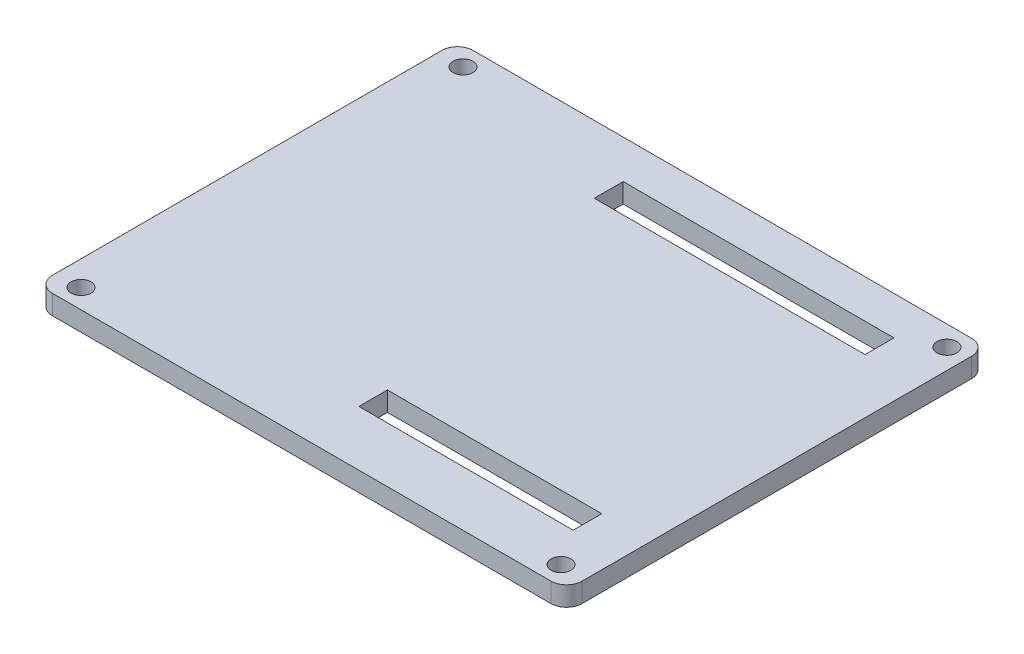
ISO-10303-21;
HEADER;
FILE_DESCRIPTION(('STEP AP214'),'2;1');
FILE_NAME('part.step','',(''),(''),'','','');
FILE_SCHEMA(('AUTOMOTIVE_DESIGN { 1 0 10303 214 1 1 1 1 }'));
ENDSEC;
DATA;
#1=APPLICATION_CONTEXT('core data for automotive mechanical design processes');
#2=APPLICATION_PROTOCOL_DEFINITION('international standard','automotive_design',2000,#1);
#3=PRODUCT_CONTEXT('',#1,'mechanical');
#4=PRODUCT('Part','Part','',(#3));
#5=PRODUCT_RELATED_PRODUCT_CATEGORY('part','',(#4));
#6=PRODUCT_DEFINITION_FORMATION('','',#4);
#7=PRODUCT_DEFINITION_CONTEXT('part definition',#1,'design');
#8=PRODUCT_DEFINITION('design','',#6,#7);
#9=PRODUCT_DEFINITION_SHAPE('','',#8);
#10=(LENGTH_UNIT() NAMED_UNIT(*) SI_UNIT(.MILLI.,.METRE.));
#11=(NAMED_UNIT(*) PLANE_ANGLE_UNIT() SI_UNIT($,.RADIAN.));
#12=(NAMED_UNIT(*) SI_UNIT($,.STERADIAN.) SOLID_ANGLE_UNIT());
#13=UNCERTAINTY_MEASURE_WITH_UNIT(LENGTH_MEASURE(1.E-05),#10,'distance_accuracy_value','');
#14=(GEOMETRIC_REPRESENTATION_CONTEXT(3) GLOBAL_UNCERTAINTY_ASSIGNED_CONTEXT((#13)) GLOBAL_UNIT_ASSIGNED_CONTEXT((#10,
#11,#12)) REPRESENTATION_CONTEXT('',''));
#15=CARTESIAN_POINT('',(0.,0.,0.));
#16=DIRECTION('',(0.,0.,1.));
#17=DIRECTION('',(1.,0.,0.));
#18=AXIS2_PLACEMENT_3D('',#15,#16,#17);
#19=CARTESIAN_POINT('',(0.,3.175,0.));
#20=DIRECTION('',(1.,0.,0.));
#21=DIRECTION('',(0.,0.,-1.));
#22=AXIS2_PLACEMENT_3D('',#19,#20,#21);
#23=PLANE('',#22);
#24=DIRECTION('',(0.,0.,1.));
#25=VECTOR('',#24,1.);
#26=CARTESIAN_POINT('',(0.,0.,0.));
#27=LINE('',#26,#25);
#28=CARTESIAN_POINT('',(0.,0.,2.54));
#29=VERTEX_POINT('',#28);
#30=CARTESIAN_POINT('',(0.,0.,66.04));
#31=VERTEX_POINT('',#30);
#32=EDGE_CURVE('E235',#29,#31,#27,.T.);
#33=ORIENTED_EDGE('',*,*,#32,.T.);
#34=DIRECTION('',(0.,-1.,0.));
#35=VECTOR('',#34,1.);
#36=CARTESIAN_POINT('',(0.,3.175,66.04));
#37=LINE('',#36,#35);
#38=CARTESIAN_POINT('',(0.,3.175,66.04));
#39=VERTEX_POINT('',#38);
#40=EDGE_CURVE('E277',#31,#39,#37,.F.);
#41=ORIENTED_EDGE('',*,*,#40,.T.);
#42=DIRECTION('',(0.,0.,1.));
#43=VECTOR('',#42,1.);
#44=CARTESIAN_POINT('',(0.,3.175,0.));
#45=LINE('',#44,#43);
#46=CARTESIAN_POINT('',(0.,3.175,2.54));
#47=VERTEX_POINT('',#46);
#48=EDGE_CURVE('E238',#47,#39,#45,.T.);
#49=ORIENTED_EDGE('',*,*,#48,.F.);
#50=DIRECTION('',(0.,-1.,0.));
#51=VECTOR('',#50,1.);
#52=CARTESIAN_POINT('',(0.,3.175,2.54));
#53=LINE('',#52,#51);
#54=EDGE_CURVE('E274',#47,#29,#53,.T.);
#55=ORIENTED_EDGE('',*,*,#54,.T.);
#56=EDGE_LOOP('',(#33,#41,#49,#55));
#57=FACE_BOUND('',#56,.T.);
#58=ADVANCED_FACE('F32',(#57),#23,.F.);
#59=CARTESIAN_POINT('',(0.,3.175,68.58));
#60=DIRECTION('',(0.,0.,-1.));
#61=DIRECTION('',(-1.,0.,0.));
#62=AXIS2_PLACEMENT_3D('',#59,#60,#61);
#63=PLANE('',#62);
#64=DIRECTION('',(1.,0.,0.));
#65=VECTOR('',#64,1.);
#66=CARTESIAN_POINT('',(0.,3.175,68.58));
#67=LINE('',#66,#65);
#68=CARTESIAN_POINT('',(2.54000000000001,3.175,68.58));
#69=VERTEX_POINT('',#68);
#70=CARTESIAN_POINT('',(83.82,3.175,68.58));
#71=VERTEX_POINT('',#70);
#72=EDGE_CURVE('E241',#69,#71,#67,.T.);
#73=ORIENTED_EDGE('',*,*,#72,.F.);
#74=DIRECTION('',(0.,-1.,0.));
#75=VECTOR('',#74,1.);
#76=CARTESIAN_POINT('',(2.54000000000001,3.175,68.58));
#77=LINE('',#76,#75);
#78=CARTESIAN_POINT('',(2.54000000000001,0.,68.58));
#79=VERTEX_POINT('',#78);
#80=EDGE_CURVE('E263',#69,#79,#77,.T.);
#81=ORIENTED_EDGE('',*,*,#80,.T.);
#82=DIRECTION('',(1.,0.,0.));
#83=VECTOR('',#82,1.);
#84=CARTESIAN_POINT('',(0.,0.,68.58));
#85=LINE('',#84,#83);
#86=CARTESIAN_POINT('',(83.82,0.,68.58));
#87=VERTEX_POINT('',#86);
#88=EDGE_CURVE('E254',#79,#87,#85,.T.);
#89=ORIENTED_EDGE('',*,*,#88,.T.);
#90=DIRECTION('',(0.,-1.,0.));
#91=VECTOR('',#90,1.);
#92=CARTESIAN_POINT('',(83.82,3.175,68.58));
#93=LINE('',#92,#91);
#94=EDGE_CURVE('E251',#87,#71,#93,.F.);
#95=ORIENTED_EDGE('',*,*,#94,.T.);
#96=EDGE_LOOP('',(#73,#81,#89,#95));
#97=FACE_BOUND('',#96,.T.);
#98=ADVANCED_FACE('F315',(#97),#63,.F.);
#99=CARTESIAN_POINT('',(86.36,3.175,0.));
#100=DIRECTION('',(-1.,0.,0.));
#101=DIRECTION('',(0.,0.,1.));
#102=AXIS2_PLACEMENT_3D('',#99,#100,#101);
#103=PLANE('',#102);
#104=DIRECTION('',(0.,0.,-1.));
#105=VECTOR('',#104,1.);
#106=CARTESIAN_POINT('',(86.36,3.175,0.));
#107=LINE('',#106,#105);
#108=CARTESIAN_POINT('',(86.36,3.175,66.04));
#109=VERTEX_POINT('',#108);
#110=CARTESIAN_POINT('',(86.36,3.175,2.54));
#111=VERTEX_POINT('',#110);
#112=EDGE_CURVE('E245',#109,#111,#107,.T.);
#113=ORIENTED_EDGE('',*,*,#112,.F.);
#114=DIRECTION('',(0.,-1.,0.));
#115=VECTOR('',#114,1.);
#116=CARTESIAN_POINT('',(86.36,3.175,66.04));
#117=LINE('',#116,#115);
#118=CARTESIAN_POINT('',(86.36,0.,66.04));
#119=VERTEX_POINT('',#118);
#120=EDGE_CURVE('E289',#109,#119,#117,.T.);
#121=ORIENTED_EDGE('',*,*,#120,.T.);
#122=DIRECTION('',(0.,0.,-1.));
#123=VECTOR('',#122,1.);
#124=CARTESIAN_POINT('',(86.36,0.,0.));
#125=LINE('',#124,#123);
#126=CARTESIAN_POINT('',(86.36,0.,2.54));
#127=VERTEX_POINT('',#126);
#128=EDGE_CURVE('E257',#119,#127,#125,.T.);
#129=ORIENTED_EDGE('',*,*,#128,.T.);
#130=DIRECTION('',(0.,-1.,0.));
#131=VECTOR('',#130,1.);
#132=CARTESIAN_POINT('',(86.36,3.175,2.54));
#133=LINE('',#132,#131);
#134=EDGE_CURVE('E287',#127,#111,#133,.F.);
#135=ORIENTED_EDGE('',*,*,#134,.T.);
#136=EDGE_LOOP('',(#113,#121,#129,#135));
#137=FACE_BOUND('',#136,.T.);
#138=ADVANCED_FACE('F324',(#137),#103,.F.);
#139=CARTESIAN_POINT('',(0.,3.175,0.));
#140=DIRECTION('',(0.,0.,1.));
#141=DIRECTION('',(1.,0.,0.));
#142=AXIS2_PLACEMENT_3D('',#139,#140,#141);
#143=PLANE('',#142);
#144=DIRECTION('',(-1.,0.,0.));
#145=VECTOR('',#144,1.);
#146=CARTESIAN_POINT('',(0.,3.175,0.));
#147=LINE('',#146,#145);
#148=CARTESIAN_POINT('',(83.82,3.175,0.));
#149=VERTEX_POINT('',#148);
#150=CARTESIAN_POINT('',(2.54,3.175,0.));
#151=VERTEX_POINT('',#150);
#152=EDGE_CURVE('E248',#149,#151,#147,.T.);
#153=ORIENTED_EDGE('',*,*,#152,.F.);
#154=DIRECTION('',(0.,-1.,0.));
#155=VECTOR('',#154,1.);
#156=CARTESIAN_POINT('',(83.82,3.175,0.));
#157=LINE('',#156,#155);
#158=CARTESIAN_POINT('',(83.82,0.,0.));
#159=VERTEX_POINT('',#158);
#160=EDGE_CURVE('E11',#149,#159,#157,.T.);
#161=ORIENTED_EDGE('',*,*,#160,.T.);
#162=DIRECTION('',(-1.,0.,0.));
#163=VECTOR('',#162,1.);
#164=CARTESIAN_POINT('',(0.,0.,0.));
#165=LINE('',#164,#163);
#166=CARTESIAN_POINT('',(2.54,0.,0.));
#167=VERTEX_POINT('',#166);
#168=EDGE_CURVE('E242',#159,#167,#165,.T.);
#169=ORIENTED_EDGE('',*,*,#168,.T.);
#170=DIRECTION('',(0.,-1.,0.));
#171=VECTOR('',#170,1.);
#172=CARTESIAN_POINT('',(2.54,3.175,0.));
#173=LINE('',#172,#171);
#174=EDGE_CURVE('E40',#167,#151,#173,.F.);
#175=ORIENTED_EDGE('',*,*,#174,.T.);
#176=EDGE_LOOP('',(#153,#161,#169,#175));
#177=FACE_BOUND('',#176,.T.);
#178=ADVANCED_FACE('F294',(#177),#143,.F.);
#179=CARTESIAN_POINT('',(0.,3.175,68.58));
#180=DIRECTION('',(0.,1.,0.));
#181=DIRECTION('',(0.,0.,1.));
#182=AXIS2_PLACEMENT_3D('',#179,#180,#181);
#183=PLANE('',#182);
#184=DIRECTION('',(0.,0.,1.));
#185=VECTOR('',#184,1.);
#186=CARTESIAN_POINT('',(43.5059533764265,3.175,59.5779422268278));
#187=LINE('',#186,#185);
#188=CARTESIAN_POINT('',(43.5059533764265,3.175,54.9195322154182));
#189=VERTEX_POINT('',#188);
#190=CARTESIAN_POINT('',(43.5059533764265,3.175,59.5779422268278));
#191=VERTEX_POINT('',#190);
#192=EDGE_CURVE('E47',#189,#191,#187,.T.);
#193=ORIENTED_EDGE('',*,*,#192,.F.);
#194=DIRECTION('',(-1.,0.,0.));
#195=VECTOR('',#194,1.);
#196=CARTESIAN_POINT('',(43.5059533764265,3.175,54.9195322154182));
#197=LINE('',#196,#195);
#198=CARTESIAN_POINT('',(78.4449932427369,3.175,54.9195322154182));
#199=VERTEX_POINT('',#198);
#200=EDGE_CURVE('E163',#199,#189,#197,.T.);
#201=ORIENTED_EDGE('',*,*,#200,.F.);
#202=DIRECTION('',(0.,0.,-1.));
#203=VECTOR('',#202,1.);
#204=CARTESIAN_POINT('',(78.4449932427369,3.175,59.5779422268278));
#205=LINE('',#204,#203);
#206=CARTESIAN_POINT('',(78.4449932427369,3.175,59.5779422268278));
#207=VERTEX_POINT('',#206);
#208=EDGE_CURVE('E166',#207,#199,#205,.T.);
#209=ORIENTED_EDGE('',*,*,#208,.F.);
#210=DIRECTION('',(1.,0.,0.));
#211=VECTOR('',#210,1.);
#212=CARTESIAN_POINT('',(43.5059533764265,3.175,59.5779422268278));
#213=LINE('',#212,#211);
#214=EDGE_CURVE('E172',#191,#207,#213,.T.);
#215=ORIENTED_EDGE('',*,*,#214,.F.);
#216=EDGE_LOOP('',(#193,#201,#209,#215));
#217=FACE_BOUND('',#216,.T.);
#218=DIRECTION('',(0.,0.,1.));
#219=VECTOR('',#218,1.);
#220=CARTESIAN_POINT('',(33.293149455498,3.175,6.27794222682778));
#221=LINE('',#220,#219);
#222=CARTESIAN_POINT('',(33.293149455498,3.175,6.27794222682778));
#223=VERTEX_POINT('',#222);
#224=CARTESIAN_POINT('',(33.293149455498,3.175,10.9907553059796));
#225=VERTEX_POINT('',#224);
#226=EDGE_CURVE('E178',#223,#225,#221,.T.);
#227=ORIENTED_EDGE('',*,*,#226,.F.);
#228=DIRECTION('',(-1.,0.,0.));
#229=VECTOR('',#228,1.);
#230=CARTESIAN_POINT('',(33.293149455498,3.175,6.27794222682778));
#231=LINE('',#230,#229);
#232=CARTESIAN_POINT('',(77.4390867704839,3.175,6.27794222682778));
#233=VERTEX_POINT('',#232);
#234=EDGE_CURVE('E186',#233,#223,#231,.T.);
#235=ORIENTED_EDGE('',*,*,#234,.F.);
#236=DIRECTION('',(0.,0.,-1.));
#237=VECTOR('',#236,1.);
#238=CARTESIAN_POINT('',(77.4390867704839,3.175,6.27794222682778));
#239=LINE('',#238,#237);
#240=CARTESIAN_POINT('',(77.4390867704839,3.175,10.9907553059796));
#241=VERTEX_POINT('',#240);
#242=EDGE_CURVE('E200',#241,#233,#239,.T.);
#243=ORIENTED_EDGE('',*,*,#242,.F.);
#244=DIRECTION('',(1.,0.,0.));
#245=VECTOR('',#244,1.);
#246=CARTESIAN_POINT('',(33.293149455498,3.175,10.9907553059796));
#247=LINE('',#246,#245);
#248=EDGE_CURVE('E197',#225,#241,#247,.T.);
#249=ORIENTED_EDGE('',*,*,#248,.F.);
#250=EDGE_LOOP('',(#227,#235,#243,#249));
#251=FACE_BOUND('',#250,.T.);
#252=CARTESIAN_POINT('',(4.05404530758346,3.175,65.4277777084644));
#253=DIRECTION('',(0.,1.,0.));
#254=DIRECTION('',(0.,0.,1.));
#255=AXIS2_PLACEMENT_3D('',#252,#253,#254);
#256=CIRCLE('',#255,1.6129);
#257=CARTESIAN_POINT('',(4.05404530758346,3.175,67.0406777084644));
#258=VERTEX_POINT('',#257);
#259=EDGE_CURVE('E207',#258,#258,#256,.T.);
#260=ORIENTED_EDGE('',*,*,#259,.F.);
#261=EDGE_LOOP('',(#260));
#262=FACE_BOUND('',#261,.T.);
#263=CARTESIAN_POINT('',(82.3059546924165,3.175,65.4277777084644));
#264=DIRECTION('',(0.,1.,0.));
#265=DIRECTION('',(0.,0.,1.));
#266=AXIS2_PLACEMENT_3D('',#263,#264,#265);
#267=CIRCLE('',#266,1.6129);
#268=CARTESIAN_POINT('',(82.3059546924165,3.175,67.0406777084644));
#269=VERTEX_POINT('',#268);
#270=EDGE_CURVE('E217',#269,#269,#267,.T.);
#271=ORIENTED_EDGE('',*,*,#270,.F.);
#272=EDGE_LOOP('',(#271));
#273=FACE_BOUND('',#272,.T.);
#274=CARTESIAN_POINT('',(83.0760512242138,3.175,3.28394877578617));
#275=DIRECTION('',(0.,1.,0.));
#276=DIRECTION('',(0.,0.,1.));
#277=AXIS2_PLACEMENT_3D('',#274,#275,#276);
#278=CIRCLE('',#277,1.6129);
#279=CARTESIAN_POINT('',(83.0760512242138,3.175,4.89684877578617));
#280=VERTEX_POINT('',#279);
#281=EDGE_CURVE('E223',#280,#280,#278,.T.);
#282=ORIENTED_EDGE('',*,*,#281,.F.);
#283=EDGE_LOOP('',(#282));
#284=FACE_BOUND('',#283,.T.);
#285=CARTESIAN_POINT('',(4.05404530758346,3.175,3.15222229153558));
#286=DIRECTION('',(0.,1.,0.));
#287=DIRECTION('',(0.,0.,1.));
#288=AXIS2_PLACEMENT_3D('',#285,#286,#287);
#289=CIRCLE('',#288,1.6129);
#290=CARTESIAN_POINT('',(4.05404530758346,3.175,4.76512229153558));
#291=VERTEX_POINT('',#290);
#292=EDGE_CURVE('E229',#291,#291,#289,.T.);
#293=ORIENTED_EDGE('',*,*,#292,.F.);
#294=EDGE_LOOP('',(#293));
#295=FACE_BOUND('',#294,.T.);
#296=ORIENTED_EDGE('',*,*,#48,.T.);
#297=CARTESIAN_POINT('',(2.54000000000001,3.175,66.04));
#298=DIRECTION('',(0.,1.,0.));
#299=DIRECTION('',(0.,0.,1.));
#300=AXIS2_PLACEMENT_3D('',#297,#298,#299);
#301=CIRCLE('',#300,2.54);
#302=EDGE_CURVE('E285',#39,#69,#301,.T.);
#303=ORIENTED_EDGE('',*,*,#302,.T.);
#304=ORIENTED_EDGE('',*,*,#72,.T.);
#305=CARTESIAN_POINT('',(83.82,3.175,66.04));
#306=DIRECTION('',(0.,1.,0.));
#307=DIRECTION('',(0.,0.,1.));
#308=AXIS2_PLACEMENT_3D('',#305,#306,#307);
#309=CIRCLE('',#308,2.54);
#310=EDGE_CURVE('E283',#71,#109,#309,.T.);
#311=ORIENTED_EDGE('',*,*,#310,.T.);
#312=ORIENTED_EDGE('',*,*,#112,.T.);
#313=CARTESIAN_POINT('',(83.82,3.175,2.54));
#314=DIRECTION('',(0.,1.,0.));
#315=DIRECTION('',(0.,0.,1.));
#316=AXIS2_PLACEMENT_3D('',#313,#314,#315);
#317=CIRCLE('',#316,2.54);
#318=EDGE_CURVE('E281',#111,#149,#317,.T.);
#319=ORIENTED_EDGE('',*,*,#318,.T.);
#320=ORIENTED_EDGE('',*,*,#152,.T.);
#321=CARTESIAN_POINT('',(2.54,3.175,2.54));
#322=DIRECTION('',(0.,1.,0.));
#323=DIRECTION('',(0.,0.,1.));
#324=AXIS2_PLACEMENT_3D('',#321,#322,#323);
#325=CIRCLE('',#324,2.54);
#326=EDGE_CURVE('E279',#151,#47,#325,.T.);
#327=ORIENTED_EDGE('',*,*,#326,.T.);
#328=EDGE_LOOP('',(#296,#303,#304,#311,#312,#319,#320,#327));
#329=FACE_BOUND('',#328,.T.);
#330=ADVANCED_FACE('F300',(#217,#251,#262,#273,#284,#295,#329),#183,.T.);
#331=CARTESIAN_POINT('',(0.,0.,68.58));
#332=DIRECTION('',(0.,1.,0.));
#333=DIRECTION('',(0.,0.,1.));
#334=AXIS2_PLACEMENT_3D('',#331,#332,#333);
#335=PLANE('',#334);
#336=DIRECTION('',(-1.,0.,0.));
#337=VECTOR('',#336,1.);
#338=CARTESIAN_POINT('',(43.5059533764265,0.,54.9195322154182));
#339=LINE('',#338,#337);
#340=CARTESIAN_POINT('',(78.4449932427369,0.,54.9195322154182));
#341=VERTEX_POINT('',#340);
#342=CARTESIAN_POINT('',(43.5059533764265,0.,54.9195322154182));
#343=VERTEX_POINT('',#342);
#344=EDGE_CURVE('E153',#341,#343,#339,.T.);
#345=ORIENTED_EDGE('',*,*,#344,.T.);
#346=DIRECTION('',(0.,0.,1.));
#347=VECTOR('',#346,1.);
#348=CARTESIAN_POINT('',(43.5059533764265,0.,59.5779422268278));
#349=LINE('',#348,#347);
#350=CARTESIAN_POINT('',(43.5059533764265,0.,59.5779422268278));
#351=VERTEX_POINT('',#350);
#352=EDGE_CURVE('E147',#343,#351,#349,.T.);
#353=ORIENTED_EDGE('',*,*,#352,.T.);
#354=DIRECTION('',(1.,0.,0.));
#355=VECTOR('',#354,1.);
#356=CARTESIAN_POINT('',(43.5059533764265,0.,59.5779422268278));
#357=LINE('',#356,#355);
#358=CARTESIAN_POINT('',(78.4449932427369,0.,59.5779422268278));
#359=VERTEX_POINT('',#358);
#360=EDGE_CURVE('E156',#351,#359,#357,.T.);
#361=ORIENTED_EDGE('',*,*,#360,.T.);
#362=DIRECTION('',(0.,0.,-1.));
#363=VECTOR('',#362,1.);
#364=CARTESIAN_POINT('',(78.4449932427369,0.,59.5779422268278));
#365=LINE('',#364,#363);
#366=EDGE_CURVE('E55',#359,#341,#365,.T.);
#367=ORIENTED_EDGE('',*,*,#366,.T.);
#368=EDGE_LOOP('',(#345,#353,#361,#367));
#369=FACE_BOUND('',#368,.T.);
#370=DIRECTION('',(-1.,0.,0.));
#371=VECTOR('',#370,1.);
#372=CARTESIAN_POINT('',(33.293149455498,0.,6.27794222682778));
#373=LINE('',#372,#371);
#374=CARTESIAN_POINT('',(77.4390867704839,0.,6.27794222682778));
#375=VERTEX_POINT('',#374);
#376=CARTESIAN_POINT('',(33.293149455498,0.,6.27794222682778));
#377=VERTEX_POINT('',#376);
#378=EDGE_CURVE('E192',#375,#377,#373,.T.);
#379=ORIENTED_EDGE('',*,*,#378,.T.);
#380=DIRECTION('',(0.,0.,1.));
#381=VECTOR('',#380,1.);
#382=CARTESIAN_POINT('',(33.293149455498,0.,6.27794222682778));
#383=LINE('',#382,#381);
#384=CARTESIAN_POINT('',(33.293149455498,0.,10.9907553059796));
#385=VERTEX_POINT('',#384);
#386=EDGE_CURVE('E182',#377,#385,#383,.T.);
#387=ORIENTED_EDGE('',*,*,#386,.T.);
#388=DIRECTION('',(1.,0.,0.));
#389=VECTOR('',#388,1.);
#390=CARTESIAN_POINT('',(33.293149455498,0.,10.9907553059796));
#391=LINE('',#390,#389);
#392=CARTESIAN_POINT('',(77.4390867704839,0.,10.9907553059796));
#393=VERTEX_POINT('',#392);
#394=EDGE_CURVE('E185',#385,#393,#391,.T.);
#395=ORIENTED_EDGE('',*,*,#394,.T.);
#396=DIRECTION('',(0.,0.,-1.));
#397=VECTOR('',#396,1.);
#398=CARTESIAN_POINT('',(77.4390867704839,0.,6.27794222682778));
#399=LINE('',#398,#397);
#400=EDGE_CURVE('E189',#393,#375,#399,.T.);
#401=ORIENTED_EDGE('',*,*,#400,.T.);
#402=EDGE_LOOP('',(#379,#387,#395,#401));
#403=FACE_BOUND('',#402,.T.);
#404=CARTESIAN_POINT('',(4.05404530758346,0.,65.4277777084644));
#405=DIRECTION('',(0.,1.,0.));
#406=DIRECTION('',(0.,0.,1.));
#407=AXIS2_PLACEMENT_3D('',#404,#405,#406);
#408=CIRCLE('',#407,1.6129);
#409=CARTESIAN_POINT('',(4.05404530758346,0.,67.0406777084644));
#410=VERTEX_POINT('',#409);
#411=EDGE_CURVE('E214',#410,#410,#408,.T.);
#412=ORIENTED_EDGE('',*,*,#411,.T.);
#413=EDGE_LOOP('',(#412));
#414=FACE_BOUND('',#413,.T.);
#415=CARTESIAN_POINT('',(82.3059546924165,0.,65.4277777084644));
#416=DIRECTION('',(0.,1.,0.));
#417=DIRECTION('',(0.,0.,1.));
#418=AXIS2_PLACEMENT_3D('',#415,#416,#417);
#419=CIRCLE('',#418,1.6129);
#420=CARTESIAN_POINT('',(82.3059546924165,0.,67.0406777084644));
#421=VERTEX_POINT('',#420);
#422=EDGE_CURVE('E220',#421,#421,#419,.T.);
#423=ORIENTED_EDGE('',*,*,#422,.T.);
#424=EDGE_LOOP('',(#423));
#425=FACE_BOUND('',#424,.T.);
#426=CARTESIAN_POINT('',(83.0760512242138,0.,3.28394877578617));
#427=DIRECTION('',(0.,1.,0.));
#428=DIRECTION('',(0.,0.,1.));
#429=AXIS2_PLACEMENT_3D('',#426,#427,#428);
#430=CIRCLE('',#429,1.6129);
#431=CARTESIAN_POINT('',(83.0760512242138,0.,4.89684877578617));
#432=VERTEX_POINT('',#431);
#433=EDGE_CURVE('E226',#432,#432,#430,.T.);
#434=ORIENTED_EDGE('',*,*,#433,.T.);
#435=EDGE_LOOP('',(#434));
#436=FACE_BOUND('',#435,.T.);
#437=CARTESIAN_POINT('',(4.05404530758346,0.,3.15222229153558));
#438=DIRECTION('',(0.,1.,0.));
#439=DIRECTION('',(0.,0.,1.));
#440=AXIS2_PLACEMENT_3D('',#437,#438,#439);
#441=CIRCLE('',#440,1.6129);
#442=CARTESIAN_POINT('',(4.05404530758346,0.,4.76512229153558));
#443=VERTEX_POINT('',#442);
#444=EDGE_CURVE('E232',#443,#443,#441,.T.);
#445=ORIENTED_EDGE('',*,*,#444,.T.);
#446=EDGE_LOOP('',(#445));
#447=FACE_BOUND('',#446,.T.);
#448=ORIENTED_EDGE('',*,*,#88,.F.);
#449=CARTESIAN_POINT('',(2.54000000000001,0.,66.04));
#450=DIRECTION('',(0.,1.,0.));
#451=DIRECTION('',(0.,0.,1.));
#452=AXIS2_PLACEMENT_3D('',#449,#450,#451);
#453=CIRCLE('',#452,2.54);
#454=EDGE_CURVE('E272',#79,#31,#453,.F.);
#455=ORIENTED_EDGE('',*,*,#454,.T.);
#456=ORIENTED_EDGE('',*,*,#32,.F.);
#457=CARTESIAN_POINT('',(2.54,0.,2.54));
#458=DIRECTION('',(0.,1.,0.));
#459=DIRECTION('',(0.,0.,1.));
#460=AXIS2_PLACEMENT_3D('',#457,#458,#459);
#461=CIRCLE('',#460,2.54);
#462=EDGE_CURVE('E266',#29,#167,#461,.F.);
#463=ORIENTED_EDGE('',*,*,#462,.T.);
#464=ORIENTED_EDGE('',*,*,#168,.F.);
#465=CARTESIAN_POINT('',(83.82,0.,2.54));
#466=DIRECTION('',(0.,1.,0.));
#467=DIRECTION('',(0.,0.,1.));
#468=AXIS2_PLACEMENT_3D('',#465,#466,#467);
#469=CIRCLE('',#468,2.54);
#470=EDGE_CURVE('E268',#159,#127,#469,.F.);
#471=ORIENTED_EDGE('',*,*,#470,.T.);
#472=ORIENTED_EDGE('',*,*,#128,.F.);
#473=CARTESIAN_POINT('',(83.82,0.,66.04));
#474=DIRECTION('',(0.,1.,0.));
#475=DIRECTION('',(0.,0.,1.));
#476=AXIS2_PLACEMENT_3D('',#473,#474,#475);
#477=CIRCLE('',#476,2.54);
#478=EDGE_CURVE('E270',#119,#87,#477,.F.);
#479=ORIENTED_EDGE('',*,*,#478,.T.);
#480=EDGE_LOOP('',(#448,#455,#456,#463,#464,#471,#472,#479));
#481=FACE_BOUND('',#480,.T.);
#482=ADVANCED_FACE('F160',(#369,#403,#414,#425,#436,#447,#481),#335,.F.);
#483=CARTESIAN_POINT('',(2.54000000000001,3.175,66.04));
#484=DIRECTION('',(0.,-1.,0.));
#485=DIRECTION('',(0.,0.,-1.));
#486=AXIS2_PLACEMENT_3D('',#483,#484,#485);
#487=CYLINDRICAL_SURFACE('',#486,2.54);
#488=ORIENTED_EDGE('',*,*,#302,.F.);
#489=ORIENTED_EDGE('',*,*,#40,.F.);
#490=ORIENTED_EDGE('',*,*,#454,.F.);
#491=ORIENTED_EDGE('',*,*,#80,.F.);
#492=EDGE_LOOP('',(#488,#489,#490,#491));
#493=FACE_BOUND('',#492,.T.);
#494=ADVANCED_FACE('F312',(#493),#487,.T.);
#495=CARTESIAN_POINT('',(83.82,3.175,66.04));
#496=DIRECTION('',(0.,-1.,0.));
#497=DIRECTION('',(0.,0.,-1.));
#498=AXIS2_PLACEMENT_3D('',#495,#496,#497);
#499=CYLINDRICAL_SURFACE('',#498,2.54);
#500=ORIENTED_EDGE('',*,*,#310,.F.);
#501=ORIENTED_EDGE('',*,*,#94,.F.);
#502=ORIENTED_EDGE('',*,*,#478,.F.);
#503=ORIENTED_EDGE('',*,*,#120,.F.);
#504=EDGE_LOOP('',(#500,#501,#502,#503));
#505=FACE_BOUND('',#504,.T.);
#506=ADVANCED_FACE('F321',(#505),#499,.T.);
#507=CARTESIAN_POINT('',(83.82,3.175,2.54));
#508=DIRECTION('',(0.,-1.,0.));
#509=DIRECTION('',(0.,0.,-1.));
#510=AXIS2_PLACEMENT_3D('',#507,#508,#509);
#511=CYLINDRICAL_SURFACE('',#510,2.54);
#512=ORIENTED_EDGE('',*,*,#318,.F.);
#513=ORIENTED_EDGE('',*,*,#134,.F.);
#514=ORIENTED_EDGE('',*,*,#470,.F.);
#515=ORIENTED_EDGE('',*,*,#160,.F.);
#516=EDGE_LOOP('',(#512,#513,#514,#515));
#517=FACE_BOUND('',#516,.T.);
#518=ADVANCED_FACE('F327',(#517),#511,.T.);
#519=CARTESIAN_POINT('',(2.54,3.175,2.54));
#520=DIRECTION('',(0.,-1.,0.));
#521=DIRECTION('',(0.,0.,-1.));
#522=AXIS2_PLACEMENT_3D('',#519,#520,#521);
#523=CYLINDRICAL_SURFACE('',#522,2.54);
#524=ORIENTED_EDGE('',*,*,#326,.F.);
#525=ORIENTED_EDGE('',*,*,#174,.F.);
#526=ORIENTED_EDGE('',*,*,#462,.F.);
#527=ORIENTED_EDGE('',*,*,#54,.F.);
#528=EDGE_LOOP('',(#524,#525,#526,#527));
#529=FACE_BOUND('',#528,.T.);
#530=ADVANCED_FACE('F34',(#529),#523,.T.);
#531=CARTESIAN_POINT('',(4.05404530758346,0.,3.15222229153558));
#532=DIRECTION('',(0.,1.,0.));
#533=DIRECTION('',(0.,0.,1.));
#534=AXIS2_PLACEMENT_3D('',#531,#532,#533);
#535=CYLINDRICAL_SURFACE('',#534,1.6129);
#536=ORIENTED_EDGE('',*,*,#444,.F.);
#537=EDGE_LOOP('',(#536));
#538=FACE_BOUND('',#537,.T.);
#539=ORIENTED_EDGE('',*,*,#292,.T.);
#540=EDGE_LOOP('',(#539));
#541=FACE_BOUND('',#540,.T.);
#542=ADVANCED_FACE('F333',(#538,#541),#535,.F.);
#543=CARTESIAN_POINT('',(83.0760512242138,0.,3.28394877578617));
#544=DIRECTION('',(0.,1.,0.));
#545=DIRECTION('',(0.,0.,1.));
#546=AXIS2_PLACEMENT_3D('',#543,#544,#545);
#547=CYLINDRICAL_SURFACE('',#546,1.6129);
#548=ORIENTED_EDGE('',*,*,#433,.F.);
#549=EDGE_LOOP('',(#548));
#550=FACE_BOUND('',#549,.T.);
#551=ORIENTED_EDGE('',*,*,#281,.T.);
#552=EDGE_LOOP('',(#551));
#553=FACE_BOUND('',#552,.T.);
#554=ADVANCED_FACE('F403',(#550,#553),#547,.F.);
#555=CARTESIAN_POINT('',(82.3059546924165,0.,65.4277777084644));
#556=DIRECTION('',(0.,1.,0.));
#557=DIRECTION('',(0.,0.,1.));
#558=AXIS2_PLACEMENT_3D('',#555,#556,#557);
#559=CYLINDRICAL_SURFACE('',#558,1.6129);
#560=ORIENTED_EDGE('',*,*,#422,.F.);
#561=EDGE_LOOP('',(#560));
#562=FACE_BOUND('',#561,.T.);
#563=ORIENTED_EDGE('',*,*,#270,.T.);
#564=EDGE_LOOP('',(#563));
#565=FACE_BOUND('',#564,.T.);
#566=ADVANCED_FACE('F411',(#562,#565),#559,.F.);
#567=CARTESIAN_POINT('',(4.05404530758346,0.,65.4277777084644));
#568=DIRECTION('',(0.,1.,0.));
#569=DIRECTION('',(0.,0.,1.));
#570=AXIS2_PLACEMENT_3D('',#567,#568,#569);
#571=CYLINDRICAL_SURFACE('',#570,1.6129);
#572=ORIENTED_EDGE('',*,*,#411,.F.);
#573=EDGE_LOOP('',(#572));
#574=FACE_BOUND('',#573,.T.);
#575=ORIENTED_EDGE('',*,*,#259,.T.);
#576=EDGE_LOOP('',(#575));
#577=FACE_BOUND('',#576,.T.);
#578=ADVANCED_FACE('F420',(#574,#577),#571,.F.);
#579=CARTESIAN_POINT('',(33.293149455498,0.,6.27794222682778));
#580=DIRECTION('',(-1.,0.,0.));
#581=DIRECTION('',(0.,0.,1.));
#582=AXIS2_PLACEMENT_3D('',#579,#580,#581);
#583=PLANE('',#582);
#584=ORIENTED_EDGE('',*,*,#226,.T.);
#585=DIRECTION('',(0.,1.,0.));
#586=VECTOR('',#585,1.);
#587=CARTESIAN_POINT('',(33.293149455498,0.,10.9907553059796));
#588=LINE('',#587,#586);
#589=EDGE_CURVE('E195',#385,#225,#588,.T.);
#590=ORIENTED_EDGE('',*,*,#589,.F.);
#591=ORIENTED_EDGE('',*,*,#386,.F.);
#592=DIRECTION('',(0.,1.,0.));
#593=VECTOR('',#592,1.);
#594=CARTESIAN_POINT('',(33.293149455498,0.,6.27794222682778));
#595=LINE('',#594,#593);
#596=EDGE_CURVE('E205',#377,#223,#595,.T.);
#597=ORIENTED_EDGE('',*,*,#596,.T.);
#598=EDGE_LOOP('',(#584,#590,#591,#597));
#599=FACE_BOUND('',#598,.T.);
#600=ADVANCED_FACE('F428',(#599),#583,.F.);
#601=CARTESIAN_POINT('',(33.293149455498,0.,6.27794222682778));
#602=DIRECTION('',(0.,0.,-1.));
#603=DIRECTION('',(-1.,0.,0.));
#604=AXIS2_PLACEMENT_3D('',#601,#602,#603);
#605=PLANE('',#604);
#606=ORIENTED_EDGE('',*,*,#234,.T.);
#607=ORIENTED_EDGE('',*,*,#596,.F.);
#608=ORIENTED_EDGE('',*,*,#378,.F.);
#609=DIRECTION('',(0.,1.,0.));
#610=VECTOR('',#609,1.);
#611=CARTESIAN_POINT('',(77.4390867704839,0.,6.27794222682778));
#612=LINE('',#611,#610);
#613=EDGE_CURVE('E208',#375,#233,#612,.T.);
#614=ORIENTED_EDGE('',*,*,#613,.T.);
#615=EDGE_LOOP('',(#606,#607,#608,#614));
#616=FACE_BOUND('',#615,.T.);
#617=ADVANCED_FACE('F436',(#616),#605,.F.);
#618=CARTESIAN_POINT('',(77.4390867704839,0.,6.27794222682778));
#619=DIRECTION('',(1.,0.,0.));
#620=DIRECTION('',(0.,0.,-1.));
#621=AXIS2_PLACEMENT_3D('',#618,#619,#620);
#622=PLANE('',#621);
#623=ORIENTED_EDGE('',*,*,#242,.T.);
#624=ORIENTED_EDGE('',*,*,#613,.F.);
#625=ORIENTED_EDGE('',*,*,#400,.F.);
#626=DIRECTION('',(0.,1.,0.));
#627=VECTOR('',#626,1.);
#628=CARTESIAN_POINT('',(77.4390867704839,0.,10.9907553059796));
#629=LINE('',#628,#627);
#630=EDGE_CURVE('E210',#393,#241,#629,.T.);
#631=ORIENTED_EDGE('',*,*,#630,.T.);
#632=EDGE_LOOP('',(#623,#624,#625,#631));
#633=FACE_BOUND('',#632,.T.);
#634=ADVANCED_FACE('F445',(#633),#622,.F.);
#635=CARTESIAN_POINT('',(33.293149455498,0.,10.9907553059796));
#636=DIRECTION('',(0.,0.,1.));
#637=DIRECTION('',(1.,0.,0.));
#638=AXIS2_PLACEMENT_3D('',#635,#636,#637);
#639=PLANE('',#638);
#640=ORIENTED_EDGE('',*,*,#248,.T.);
#641=ORIENTED_EDGE('',*,*,#630,.F.);
#642=ORIENTED_EDGE('',*,*,#394,.F.);
#643=ORIENTED_EDGE('',*,*,#589,.T.);
#644=EDGE_LOOP('',(#640,#641,#642,#643));
#645=FACE_BOUND('',#644,.T.);
#646=ADVANCED_FACE('F454',(#645),#639,.F.);
#647=CARTESIAN_POINT('',(43.5059533764265,0.,59.5779422268278));
#648=DIRECTION('',(-1.,0.,0.));
#649=DIRECTION('',(0.,0.,1.));
#650=AXIS2_PLACEMENT_3D('',#647,#648,#649);
#651=PLANE('',#650);
#652=ORIENTED_EDGE('',*,*,#192,.T.);
#653=DIRECTION('',(0.,1.,0.));
#654=VECTOR('',#653,1.);
#655=CARTESIAN_POINT('',(43.5059533764265,0.,59.5779422268278));
#656=LINE('',#655,#654);
#657=EDGE_CURVE('E143',#351,#191,#656,.T.);
#658=ORIENTED_EDGE('',*,*,#657,.F.);
#659=ORIENTED_EDGE('',*,*,#352,.F.);
#660=DIRECTION('',(0.,1.,0.));
#661=VECTOR('',#660,1.);
#662=CARTESIAN_POINT('',(43.5059533764265,0.,54.9195322154182));
#663=LINE('',#662,#661);
#664=EDGE_CURVE('E176',#343,#189,#663,.T.);
#665=ORIENTED_EDGE('',*,*,#664,.T.);
#666=EDGE_LOOP('',(#652,#658,#659,#665));
#667=FACE_BOUND('',#666,.T.);
#668=ADVANCED_FACE('F145',(#667),#651,.F.);
#669=CARTESIAN_POINT('',(43.5059533764265,0.,54.9195322154182));
#670=DIRECTION('',(0.,0.,-1.));
#671=DIRECTION('',(-1.,0.,0.));
#672=AXIS2_PLACEMENT_3D('',#669,#670,#671);
#673=PLANE('',#672);
#674=ORIENTED_EDGE('',*,*,#200,.T.);
#675=ORIENTED_EDGE('',*,*,#664,.F.);
#676=ORIENTED_EDGE('',*,*,#344,.F.);
#677=DIRECTION('',(0.,1.,0.));
#678=VECTOR('',#677,1.);
#679=CARTESIAN_POINT('',(78.4449932427369,0.,54.9195322154182));
#680=LINE('',#679,#678);
#681=EDGE_CURVE('E179',#341,#199,#680,.T.);
#682=ORIENTED_EDGE('',*,*,#681,.T.);
#683=EDGE_LOOP('',(#674,#675,#676,#682));
#684=FACE_BOUND('',#683,.T.);
#685=ADVANCED_FACE('F471',(#684),#673,.F.);
#686=CARTESIAN_POINT('',(78.4449932427369,0.,59.5779422268278));
#687=DIRECTION('',(1.,0.,0.));
#688=DIRECTION('',(0.,0.,-1.));
#689=AXIS2_PLACEMENT_3D('',#686,#687,#688);
#690=PLANE('',#689);
#691=ORIENTED_EDGE('',*,*,#208,.T.);
#692=ORIENTED_EDGE('',*,*,#681,.F.);
#693=ORIENTED_EDGE('',*,*,#366,.F.);
#694=DIRECTION('',(0.,1.,0.));
#695=VECTOR('',#694,1.);
#696=CARTESIAN_POINT('',(78.4449932427369,0.,59.5779422268278));
#697=LINE('',#696,#695);
#698=EDGE_CURVE('E152',#359,#207,#697,.T.);
#699=ORIENTED_EDGE('',*,*,#698,.T.);
#700=EDGE_LOOP('',(#691,#692,#693,#699));
#701=FACE_BOUND('',#700,.T.);
#702=ADVANCED_FACE('F479',(#701),#690,.F.);
#703=CARTESIAN_POINT('',(43.5059533764265,0.,59.5779422268278));
#704=DIRECTION('',(0.,0.,1.));
#705=DIRECTION('',(1.,0.,0.));
#706=AXIS2_PLACEMENT_3D('',#703,#704,#705);
#707=PLANE('',#706);
#708=ORIENTED_EDGE('',*,*,#214,.T.);
#709=ORIENTED_EDGE('',*,*,#698,.F.);
#710=ORIENTED_EDGE('',*,*,#360,.F.);
#711=ORIENTED_EDGE('',*,*,#657,.T.);
#712=EDGE_LOOP('',(#708,#709,#710,#711));
#713=FACE_BOUND('',#712,.T.);
#714=ADVANCED_FACE('F157',(#713),#707,.F.);
#715=CLOSED_SHELL('',(#58,#98,#138,#178,#330,#482,#494,#506,#518,#530,#542,#554,#566,#578,#600,
#617,#634,#646,#668,#685,#702,#714));
#716=MANIFOLD_SOLID_BREP('B2',#715);
#717=ADVANCED_BREP_SHAPE_REPRESENTATION('',(#18,#716),#14);
#718=SHAPE_DEFINITION_REPRESENTATION(#9,#717);
ENDSEC;
END-ISO-10303-21;
